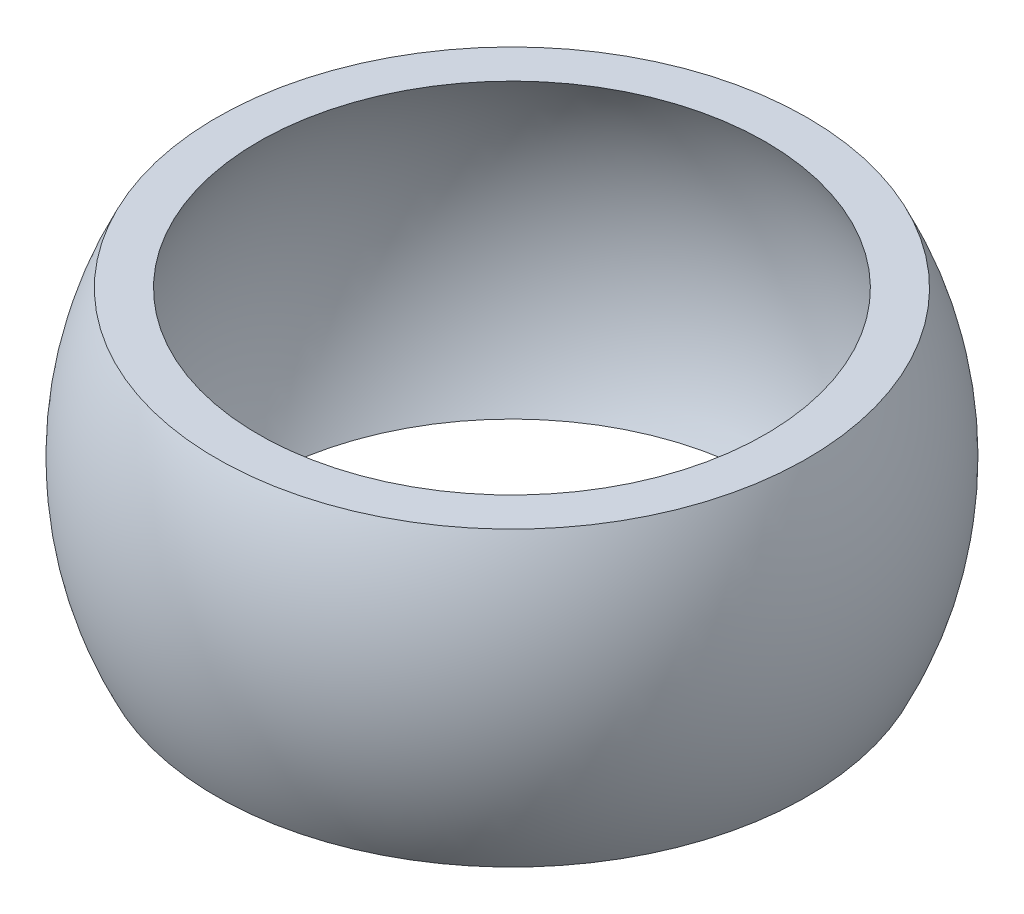
ISO-10303-21;
HEADER;
FILE_DESCRIPTION(('STEP AP214'),'2;1');
FILE_NAME('part.step','',(''),(''),'','','');
FILE_SCHEMA(('AUTOMOTIVE_DESIGN { 1 0 10303 214 1 1 1 1 }'));
ENDSEC;
DATA;
#1=APPLICATION_CONTEXT('core data for automotive mechanical design processes');
#2=APPLICATION_PROTOCOL_DEFINITION('international standard','automotive_design',2000,#1);
#3=PRODUCT_CONTEXT('',#1,'mechanical');
#4=PRODUCT('Part','Part','',(#3));
#5=PRODUCT_RELATED_PRODUCT_CATEGORY('part','',(#4));
#6=PRODUCT_DEFINITION_FORMATION('','',#4);
#7=PRODUCT_DEFINITION_CONTEXT('part definition',#1,'design');
#8=PRODUCT_DEFINITION('design','',#6,#7);
#9=PRODUCT_DEFINITION_SHAPE('','',#8);
#10=(LENGTH_UNIT() NAMED_UNIT(*) SI_UNIT(.MILLI.,.METRE.));
#11=(NAMED_UNIT(*) PLANE_ANGLE_UNIT() SI_UNIT($,.RADIAN.));
#12=(NAMED_UNIT(*) SI_UNIT($,.STERADIAN.) SOLID_ANGLE_UNIT());
#13=UNCERTAINTY_MEASURE_WITH_UNIT(LENGTH_MEASURE(1.E-05),#10,'distance_accuracy_value','');
#14=(GEOMETRIC_REPRESENTATION_CONTEXT(3) GLOBAL_UNCERTAINTY_ASSIGNED_CONTEXT((#13)) GLOBAL_UNIT_ASSIGNED_CONTEXT((#10,
#11,#12)) REPRESENTATION_CONTEXT('',''));
#15=CARTESIAN_POINT('',(0.,0.,0.));
#16=DIRECTION('',(0.,0.,1.));
#17=DIRECTION('',(1.,0.,0.));
#18=AXIS2_PLACEMENT_3D('',#15,#16,#17);
#19=CARTESIAN_POINT('',(0.,0.,0.));
#20=DIRECTION('',(0.,-1.,0.));
#21=DIRECTION('',(1.,0.,0.));
#22=AXIS2_PLACEMENT_3D('',#19,#20,#21);
#23=SPHERICAL_SURFACE('',#22,3.5);
#24=CARTESIAN_POINT('',(0.,-1.75,0.));
#25=DIRECTION('',(0.,-1.,0.));
#26=DIRECTION('',(0.,0.,-1.));
#27=AXIS2_PLACEMENT_3D('',#24,#25,#26);
#28=CIRCLE('',#27,3.03108891324554);
#29=CARTESIAN_POINT('',(0.,-1.75,-3.03108891324554));
#30=VERTEX_POINT('',#29);
#31=EDGE_CURVE('E47',#30,#30,#28,.T.);
#32=ORIENTED_EDGE('',*,*,#31,.T.);
#33=EDGE_LOOP('',(#32));
#34=FACE_BOUND('',#33,.T.);
#35=CARTESIAN_POINT('',(0.,1.75,0.));
#36=DIRECTION('',(0.,-1.,0.));
#37=DIRECTION('',(0.,0.,-1.));
#38=AXIS2_PLACEMENT_3D('',#35,#36,#37);
#39=CIRCLE('',#38,3.03108891324554);
#40=CARTESIAN_POINT('',(0.,1.75,-3.03108891324554));
#41=VERTEX_POINT('',#40);
#42=EDGE_CURVE('E10',#41,#41,#39,.T.);
#43=ORIENTED_EDGE('',*,*,#42,.F.);
#44=EDGE_LOOP('',(#43));
#45=FACE_BOUND('',#44,.T.);
#46=ADVANCED_FACE('F33',(#34,#45),#23,.F.);
#47=CARTESIAN_POINT('',(3.03108891324554,1.75,0.));
#48=DIRECTION('',(0.,1.,0.));
#49=DIRECTION('',(0.,0.,1.));
#50=AXIS2_PLACEMENT_3D('',#47,#48,#49);
#51=PLANE('',#50);
#52=ORIENTED_EDGE('',*,*,#42,.T.);
#53=EDGE_LOOP('',(#52));
#54=FACE_BOUND('',#53,.T.);
#55=CARTESIAN_POINT('',(0.,1.75,0.));
#56=DIRECTION('',(0.,-1.,0.));
#57=DIRECTION('',(0.,0.,-1.));
#58=AXIS2_PLACEMENT_3D('',#55,#56,#57);
#59=CIRCLE('',#58,3.53108891324554);
#60=CARTESIAN_POINT('',(0.,1.75,-3.53108891324554));
#61=VERTEX_POINT('',#60);
#62=EDGE_CURVE('E39',#61,#61,#59,.T.);
#63=ORIENTED_EDGE('',*,*,#62,.F.);
#64=EDGE_LOOP('',(#63));
#65=FACE_BOUND('',#64,.T.);
#66=ADVANCED_FACE('F63',(#54,#65),#51,.T.);
#67=CARTESIAN_POINT('',(0.,0.,0.));
#68=DIRECTION('',(0.,-1.,0.));
#69=DIRECTION('',(1.,0.,0.));
#70=AXIS2_PLACEMENT_3D('',#67,#68,#69);
#71=SPHERICAL_SURFACE('',#70,3.94095025510923);
#72=ORIENTED_EDGE('',*,*,#62,.T.);
#73=EDGE_LOOP('',(#72));
#74=FACE_BOUND('',#73,.T.);
#75=CARTESIAN_POINT('',(0.,-1.75,0.));
#76=DIRECTION('',(0.,-1.,0.));
#77=DIRECTION('',(0.,0.,-1.));
#78=AXIS2_PLACEMENT_3D('',#75,#76,#77);
#79=CIRCLE('',#78,3.53108891324553);
#80=CARTESIAN_POINT('',(0.,-1.75,-3.53108891324553));
#81=VERTEX_POINT('',#80);
#82=EDGE_CURVE('E43',#81,#81,#79,.T.);
#83=ORIENTED_EDGE('',*,*,#82,.F.);
#84=EDGE_LOOP('',(#83));
#85=FACE_BOUND('',#84,.T.);
#86=ADVANCED_FACE('F57',(#74,#85),#71,.T.);
#87=CARTESIAN_POINT('',(3.03108891324554,-1.75,0.));
#88=DIRECTION('',(0.,-1.,0.));
#89=DIRECTION('',(0.,0.,-1.));
#90=AXIS2_PLACEMENT_3D('',#87,#88,#89);
#91=PLANE('',#90);
#92=ORIENTED_EDGE('',*,*,#82,.T.);
#93=EDGE_LOOP('',(#92));
#94=FACE_BOUND('',#93,.T.);
#95=ORIENTED_EDGE('',*,*,#31,.F.);
#96=EDGE_LOOP('',(#95));
#97=FACE_BOUND('',#96,.T.);
#98=ADVANCED_FACE('F55',(#94,#97),#91,.T.);
#99=CLOSED_SHELL('',(#46,#66,#86,#98));
#100=MANIFOLD_SOLID_BREP('B2',#99);
#101=ADVANCED_BREP_SHAPE_REPRESENTATION('',(#18,#100),#14);
#102=SHAPE_DEFINITION_REPRESENTATION(#9,#101);
ENDSEC;
END-ISO-10303-21;
